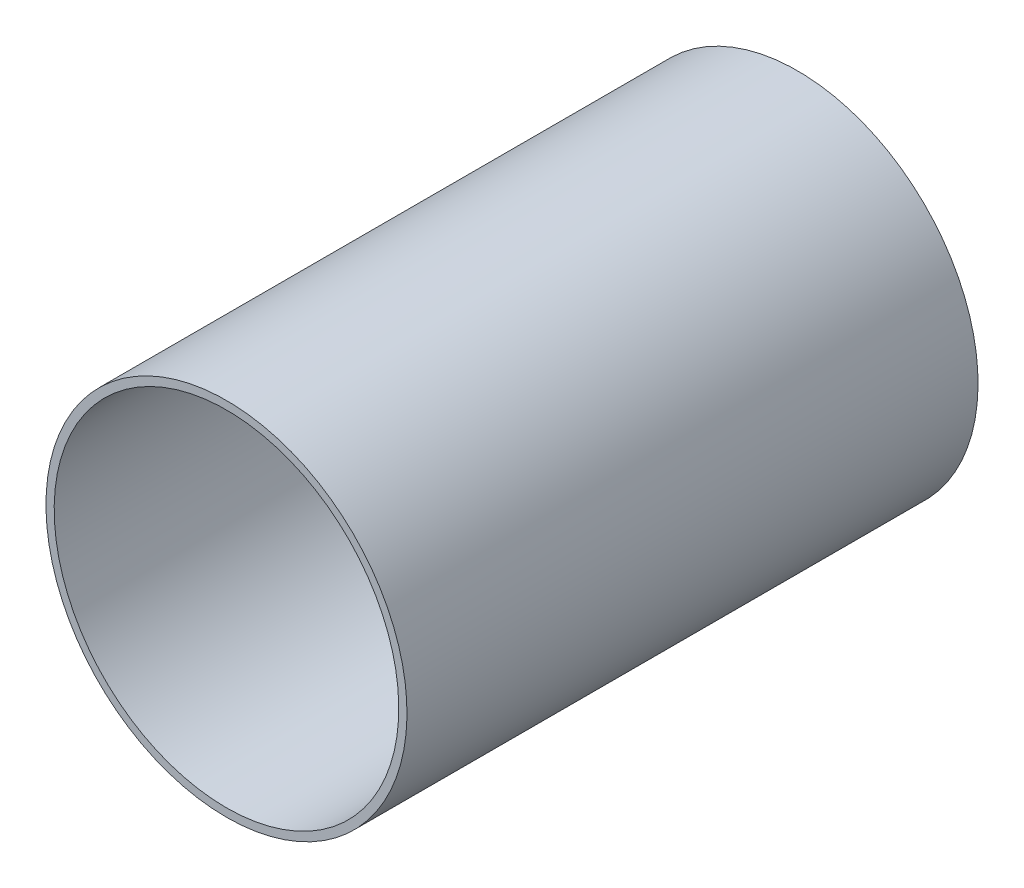
ISO-10303-21;
HEADER;
FILE_DESCRIPTION(('STEP AP214'),'2;1');
FILE_NAME('part.step','',(''),(''),'','','');
FILE_SCHEMA(('AUTOMOTIVE_DESIGN { 1 0 10303 214 1 1 1 1 }'));
ENDSEC;
DATA;
#1=APPLICATION_CONTEXT('core data for automotive mechanical design processes');
#2=APPLICATION_PROTOCOL_DEFINITION('international standard','automotive_design',2000,#1);
#3=PRODUCT_CONTEXT('',#1,'mechanical');
#4=PRODUCT('Part','Part','',(#3));
#5=PRODUCT_RELATED_PRODUCT_CATEGORY('part','',(#4));
#6=PRODUCT_DEFINITION_FORMATION('','',#4);
#7=PRODUCT_DEFINITION_CONTEXT('part definition',#1,'design');
#8=PRODUCT_DEFINITION('design','',#6,#7);
#9=PRODUCT_DEFINITION_SHAPE('','',#8);
#10=(LENGTH_UNIT() NAMED_UNIT(*) SI_UNIT(.MILLI.,.METRE.));
#11=(NAMED_UNIT(*) PLANE_ANGLE_UNIT() SI_UNIT($,.RADIAN.));
#12=(NAMED_UNIT(*) SI_UNIT($,.STERADIAN.) SOLID_ANGLE_UNIT());
#13=UNCERTAINTY_MEASURE_WITH_UNIT(LENGTH_MEASURE(1.E-05),#10,'distance_accuracy_value','');
#14=(GEOMETRIC_REPRESENTATION_CONTEXT(3) GLOBAL_UNCERTAINTY_ASSIGNED_CONTEXT((#13)) GLOBAL_UNIT_ASSIGNED_CONTEXT((#10,
#11,#12)) REPRESENTATION_CONTEXT('',''));
#15=CARTESIAN_POINT('',(0.,0.,0.));
#16=DIRECTION('',(0.,0.,1.));
#17=DIRECTION('',(1.,0.,0.));
#18=AXIS2_PLACEMENT_3D('',#15,#16,#17);
#19=CARTESIAN_POINT('',(158.952,-121.234,-0.045));
#20=DIRECTION('',(0.,0.,-1.));
#21=DIRECTION('',(0.,-1.,0.));
#22=AXIS2_PLACEMENT_3D('',#19,#20,#21);
#23=CYLINDRICAL_SURFACE('',#22,0.525);
#24=CARTESIAN_POINT('',(158.952,-121.234,-0.035));
#25=DIRECTION('',(0.,0.,-1.));
#26=DIRECTION('',(0.,-1.,0.));
#27=AXIS2_PLACEMENT_3D('',#24,#25,#26);
#28=CIRCLE('',#27,0.525);
#29=CARTESIAN_POINT('',(158.952,-121.759,-0.035));
#30=VERTEX_POINT('',#29);
#31=EDGE_CURVE('E64',#30,#30,#28,.T.);
#32=ORIENTED_EDGE('',*,*,#31,.T.);
#33=DIRECTION('',(0.,0.,1.));
#34=VECTOR('',#33,1.);
#35=CARTESIAN_POINT('',(158.952,-121.759,-0.045));
#36=LINE('',#35,#34);
#37=CARTESIAN_POINT('',(158.952,-121.759,1.705));
#38=VERTEX_POINT('',#37);
#39=EDGE_CURVE('E11',#30,#38,#36,.T.);
#40=ORIENTED_EDGE('',*,*,#39,.T.);
#41=CARTESIAN_POINT('',(158.952,-121.234,1.705));
#42=DIRECTION('',(0.,0.,-1.));
#43=DIRECTION('',(0.,-1.,0.));
#44=AXIS2_PLACEMENT_3D('',#41,#42,#43);
#45=CIRCLE('',#44,0.525);
#46=EDGE_CURVE('E25',#38,#38,#45,.T.);
#47=ORIENTED_EDGE('',*,*,#46,.F.);
#48=ORIENTED_EDGE('',*,*,#39,.F.);
#49=EDGE_LOOP('',(#32,#40,#47,#48));
#50=FACE_BOUND('',#49,.T.);
#51=ADVANCED_FACE('F17',(#50),#23,.F.);
#52=CARTESIAN_POINT('',(158.952,-121.784,1.705));
#53=DIRECTION('',(0.,0.,1.));
#54=DIRECTION('',(1.,0.,0.));
#55=AXIS2_PLACEMENT_3D('',#52,#53,#54);
#56=PLANE('',#55);
#57=ORIENTED_EDGE('',*,*,#46,.T.);
#58=EDGE_LOOP('',(#57));
#59=FACE_BOUND('',#58,.T.);
#60=CARTESIAN_POINT('',(158.952,-121.234,1.705));
#61=DIRECTION('',(0.,0.,1.));
#62=DIRECTION('',(0.,-1.,0.));
#63=AXIS2_PLACEMENT_3D('',#60,#61,#62);
#64=CIRCLE('',#63,0.55);
#65=CARTESIAN_POINT('',(158.952,-121.784,1.705));
#66=VERTEX_POINT('',#65);
#67=EDGE_CURVE('E56',#66,#66,#64,.T.);
#68=ORIENTED_EDGE('',*,*,#67,.T.);
#69=EDGE_LOOP('',(#68));
#70=FACE_BOUND('',#69,.T.);
#71=ADVANCED_FACE('F73',(#59,#70),#56,.T.);
#72=CARTESIAN_POINT('',(158.952,-121.784,-0.035));
#73=DIRECTION('',(0.,0.,1.));
#74=DIRECTION('',(1.,0.,0.));
#75=AXIS2_PLACEMENT_3D('',#72,#73,#74);
#76=PLANE('',#75);
#77=ORIENTED_EDGE('',*,*,#31,.F.);
#78=EDGE_LOOP('',(#77));
#79=FACE_BOUND('',#78,.T.);
#80=CARTESIAN_POINT('',(158.952,-121.234,-0.035));
#81=DIRECTION('',(0.,0.,1.));
#82=DIRECTION('',(0.,-1.,0.));
#83=AXIS2_PLACEMENT_3D('',#80,#81,#82);
#84=CIRCLE('',#83,0.55);
#85=CARTESIAN_POINT('',(158.952,-121.784,-0.035));
#86=VERTEX_POINT('',#85);
#87=EDGE_CURVE('E55',#86,#86,#84,.T.);
#88=ORIENTED_EDGE('',*,*,#87,.F.);
#89=EDGE_LOOP('',(#88));
#90=FACE_BOUND('',#89,.T.);
#91=ADVANCED_FACE('F82',(#79,#90),#76,.F.);
#92=CARTESIAN_POINT('',(158.952,-121.234,-0.035));
#93=DIRECTION('',(0.,0.,-1.));
#94=DIRECTION('',(0.,-1.,0.));
#95=AXIS2_PLACEMENT_3D('',#92,#93,#94);
#96=CYLINDRICAL_SURFACE('',#95,0.55);
#97=ORIENTED_EDGE('',*,*,#87,.T.);
#98=DIRECTION('',(0.,0.,1.));
#99=VECTOR('',#98,1.);
#100=CARTESIAN_POINT('',(158.952,-121.784,-0.035));
#101=LINE('',#100,#99);
#102=EDGE_CURVE('E52',#86,#66,#101,.T.);
#103=ORIENTED_EDGE('',*,*,#102,.T.);
#104=ORIENTED_EDGE('',*,*,#67,.F.);
#105=ORIENTED_EDGE('',*,*,#102,.F.);
#106=EDGE_LOOP('',(#97,#103,#104,#105));
#107=FACE_BOUND('',#106,.T.);
#108=ADVANCED_FACE('F53',(#107),#96,.T.);
#109=CLOSED_SHELL('',(#51,#71,#91,#108));
#110=MANIFOLD_SOLID_BREP('B1',#109);
#111=ADVANCED_BREP_SHAPE_REPRESENTATION('',(#18,#110),#14);
#112=SHAPE_DEFINITION_REPRESENTATION(#9,#111);
ENDSEC;
END-ISO-10303-21;
